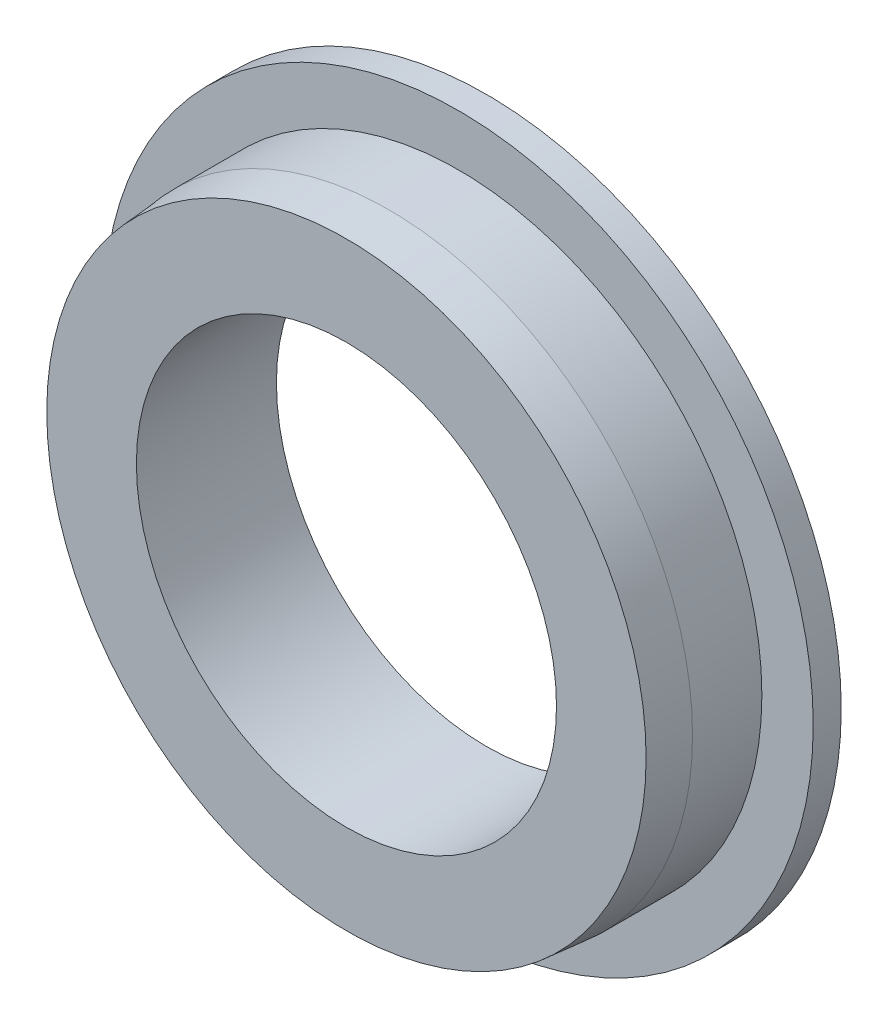
ISO-10303-21;
HEADER;
FILE_DESCRIPTION(('STEP AP214'),'2;1');
FILE_NAME('part.step','',(''),(''),'','','');
FILE_SCHEMA(('AUTOMOTIVE_DESIGN { 1 0 10303 214 1 1 1 1 }'));
ENDSEC;
DATA;
#1=APPLICATION_CONTEXT('core data for automotive mechanical design processes');
#2=APPLICATION_PROTOCOL_DEFINITION('international standard','automotive_design',2000,#1);
#3=PRODUCT_CONTEXT('',#1,'mechanical');
#4=PRODUCT('Part','Part','',(#3));
#5=PRODUCT_RELATED_PRODUCT_CATEGORY('part','',(#4));
#6=PRODUCT_DEFINITION_FORMATION('','',#4);
#7=PRODUCT_DEFINITION_CONTEXT('part definition',#1,'design');
#8=PRODUCT_DEFINITION('design','',#6,#7);
#9=PRODUCT_DEFINITION_SHAPE('','',#8);
#10=(LENGTH_UNIT() NAMED_UNIT(*) SI_UNIT(.MILLI.,.METRE.));
#11=(NAMED_UNIT(*) PLANE_ANGLE_UNIT() SI_UNIT($,.RADIAN.));
#12=(NAMED_UNIT(*) SI_UNIT($,.STERADIAN.) SOLID_ANGLE_UNIT());
#13=UNCERTAINTY_MEASURE_WITH_UNIT(LENGTH_MEASURE(1.E-05),#10,'distance_accuracy_value','');
#14=(GEOMETRIC_REPRESENTATION_CONTEXT(3) GLOBAL_UNCERTAINTY_ASSIGNED_CONTEXT((#13)) GLOBAL_UNIT_ASSIGNED_CONTEXT((#10,
#11,#12)) REPRESENTATION_CONTEXT('',''));
#15=CARTESIAN_POINT('',(0.,0.,0.));
#16=DIRECTION('',(0.,0.,1.));
#17=DIRECTION('',(1.,0.,0.));
#18=AXIS2_PLACEMENT_3D('',#15,#16,#17);
#19=CARTESIAN_POINT('',(0.,0.,0.9525));
#20=DIRECTION('',(0.,0.,-1.));
#21=DIRECTION('',(-1.,0.,0.));
#22=AXIS2_PLACEMENT_3D('',#19,#20,#21);
#23=CYLINDRICAL_SURFACE('',#22,24.13);
#24=CARTESIAN_POINT('',(0.,0.,0.9525));
#25=DIRECTION('',(0.,0.,1.));
#26=DIRECTION('',(1.,0.,0.));
#27=AXIS2_PLACEMENT_3D('',#24,#25,#26);
#28=CIRCLE('',#27,24.13);
#29=CARTESIAN_POINT('',(24.13,0.,0.9525));
#30=VERTEX_POINT('',#29);
#31=EDGE_CURVE('E58',#30,#30,#28,.T.);
#32=ORIENTED_EDGE('',*,*,#31,.F.);
#33=EDGE_LOOP('',(#32));
#34=FACE_BOUND('',#33,.T.);
#35=CARTESIAN_POINT('',(0.,0.,-0.9525));
#36=DIRECTION('',(0.,0.,1.));
#37=DIRECTION('',(1.,0.,0.));
#38=AXIS2_PLACEMENT_3D('',#35,#36,#37);
#39=CIRCLE('',#38,24.13);
#40=CARTESIAN_POINT('',(24.13,0.,-0.9525));
#41=VERTEX_POINT('',#40);
#42=EDGE_CURVE('E61',#41,#41,#39,.T.);
#43=ORIENTED_EDGE('',*,*,#42,.T.);
#44=EDGE_LOOP('',(#43));
#45=FACE_BOUND('',#44,.T.);
#46=ADVANCED_FACE('F39',(#34,#45),#23,.T.);
#47=CARTESIAN_POINT('',(0.,0.,0.9525));
#48=DIRECTION('',(0.,0.,1.));
#49=DIRECTION('',(1.,0.,0.));
#50=AXIS2_PLACEMENT_3D('',#47,#48,#49);
#51=PLANE('',#50);
#52=CARTESIAN_POINT('',(0.,0.,0.9525));
#53=DIRECTION('',(0.,0.,1.));
#54=DIRECTION('',(1.,0.,0.));
#55=AXIS2_PLACEMENT_3D('',#52,#53,#54);
#56=CIRCLE('',#55,20.6375);
#57=CARTESIAN_POINT('',(20.6375,0.,0.9525));
#58=VERTEX_POINT('',#57);
#59=EDGE_CURVE('E53',#58,#58,#56,.T.);
#60=ORIENTED_EDGE('',*,*,#59,.F.);
#61=EDGE_LOOP('',(#60));
#62=FACE_BOUND('',#61,.T.);
#63=ORIENTED_EDGE('',*,*,#31,.T.);
#64=EDGE_LOOP('',(#63));
#65=FACE_BOUND('',#64,.T.);
#66=ADVANCED_FACE('F89',(#62,#65),#51,.T.);
#67=CARTESIAN_POINT('',(0.,0.,-0.9525));
#68=DIRECTION('',(0.,0.,1.));
#69=DIRECTION('',(1.,0.,0.));
#70=AXIS2_PLACEMENT_3D('',#67,#68,#69);
#71=PLANE('',#70);
#72=CARTESIAN_POINT('',(0.,0.,-0.9525));
#73=DIRECTION('',(0.,0.,-1.));
#74=DIRECTION('',(-1.,0.,0.));
#75=AXIS2_PLACEMENT_3D('',#72,#73,#74);
#76=CIRCLE('',#75,14.2875);
#77=CARTESIAN_POINT('',(-14.2875,0.,-0.9525));
#78=VERTEX_POINT('',#77);
#79=EDGE_CURVE('E69',#78,#78,#76,.T.);
#80=ORIENTED_EDGE('',*,*,#79,.F.);
#81=EDGE_LOOP('',(#80));
#82=FACE_BOUND('',#81,.T.);
#83=ORIENTED_EDGE('',*,*,#42,.F.);
#84=EDGE_LOOP('',(#83));
#85=FACE_BOUND('',#84,.T.);
#86=ADVANCED_FACE('F85',(#82,#85),#71,.F.);
#87=CARTESIAN_POINT('',(0.,0.,8.5725));
#88=DIRECTION('',(0.,0.,-1.));
#89=DIRECTION('',(-1.,0.,0.));
#90=AXIS2_PLACEMENT_3D('',#87,#88,#89);
#91=CYLINDRICAL_SURFACE('',#90,20.6375);
#92=CARTESIAN_POINT('',(0.,0.,5.66926671509458));
#93=DIRECTION('',(0.,0.,1.));
#94=DIRECTION('',(1.,0.,0.));
#95=AXIS2_PLACEMENT_3D('',#92,#93,#94);
#96=CIRCLE('',#95,20.6375);
#97=CARTESIAN_POINT('',(20.6375,0.,5.66926671509458));
#98=VERTEX_POINT('',#97);
#99=EDGE_CURVE('E10',#98,#98,#96,.F.);
#100=ORIENTED_EDGE('',*,*,#99,.T.);
#101=EDGE_LOOP('',(#100));
#102=FACE_BOUND('',#101,.T.);
#103=ORIENTED_EDGE('',*,*,#59,.T.);
#104=EDGE_LOOP('',(#103));
#105=FACE_BOUND('',#104,.T.);
#106=ADVANCED_FACE('F88',(#102,#105),#91,.T.);
#107=CARTESIAN_POINT('',(0.,0.,8.5725));
#108=DIRECTION('',(0.,0.,1.));
#109=DIRECTION('',(1.,0.,0.));
#110=AXIS2_PLACEMENT_3D('',#107,#108,#109);
#111=PLANE('',#110);
#112=CARTESIAN_POINT('',(0.,0.,8.5725));
#113=DIRECTION('',(0.,0.,1.));
#114=DIRECTION('',(1.,0.,0.));
#115=AXIS2_PLACEMENT_3D('',#112,#113,#114);
#116=CIRCLE('',#115,20.3834999999996);
#117=CARTESIAN_POINT('',(20.3834999999996,0.,8.5725));
#118=VERTEX_POINT('',#117);
#119=EDGE_CURVE('E48',#118,#118,#116,.T.);
#120=ORIENTED_EDGE('',*,*,#119,.T.);
#121=EDGE_LOOP('',(#120));
#122=FACE_BOUND('',#121,.T.);
#123=CARTESIAN_POINT('',(0.,0.,8.5725));
#124=DIRECTION('',(0.,0.,-1.));
#125=DIRECTION('',(-1.,0.,0.));
#126=AXIS2_PLACEMENT_3D('',#123,#124,#125);
#127=CIRCLE('',#126,14.2875);
#128=CARTESIAN_POINT('',(-14.2875,0.,8.5725));
#129=VERTEX_POINT('',#128);
#130=EDGE_CURVE('E65',#129,#129,#127,.T.);
#131=ORIENTED_EDGE('',*,*,#130,.T.);
#132=EDGE_LOOP('',(#131));
#133=FACE_BOUND('',#132,.T.);
#134=ADVANCED_FACE('F77',(#122,#133),#111,.T.);
#135=CARTESIAN_POINT('',(0.,0.,8.5725));
#136=DIRECTION('',(0.,0.,-1.));
#137=DIRECTION('',(-1.,0.,0.));
#138=AXIS2_PLACEMENT_3D('',#135,#136,#137);
#139=CYLINDRICAL_SURFACE('',#138,14.2875);
#140=ORIENTED_EDGE('',*,*,#130,.F.);
#141=EDGE_LOOP('',(#140));
#142=FACE_BOUND('',#141,.T.);
#143=ORIENTED_EDGE('',*,*,#79,.T.);
#144=EDGE_LOOP('',(#143));
#145=FACE_BOUND('',#144,.T.);
#146=ADVANCED_FACE('F79',(#142,#145),#139,.F.);
#147=CARTESIAN_POINT('',(0.,0.,8.5725));
#148=DIRECTION('',(0.,0.,-1.));
#149=DIRECTION('',(-1.,0.,0.));
#150=AXIS2_PLACEMENT_3D('',#147,#148,#149);
#151=CONICAL_SURFACE('',#150,20.3834999999996,0.0872664625997204);
#152=ORIENTED_EDGE('',*,*,#99,.F.);
#153=EDGE_LOOP('',(#152));
#154=FACE_BOUND('',#153,.T.);
#155=ORIENTED_EDGE('',*,*,#119,.F.);
#156=EDGE_LOOP('',(#155));
#157=FACE_BOUND('',#156,.T.);
#158=ADVANCED_FACE('F42',(#154,#157),#151,.T.);
#159=CLOSED_SHELL('',(#46,#66,#86,#106,#134,#146,#158));
#160=MANIFOLD_SOLID_BREP('B2',#159);
#161=ADVANCED_BREP_SHAPE_REPRESENTATION('',(#18,#160),#14);
#162=SHAPE_DEFINITION_REPRESENTATION(#9,#161);
ENDSEC;
END-ISO-10303-21;
